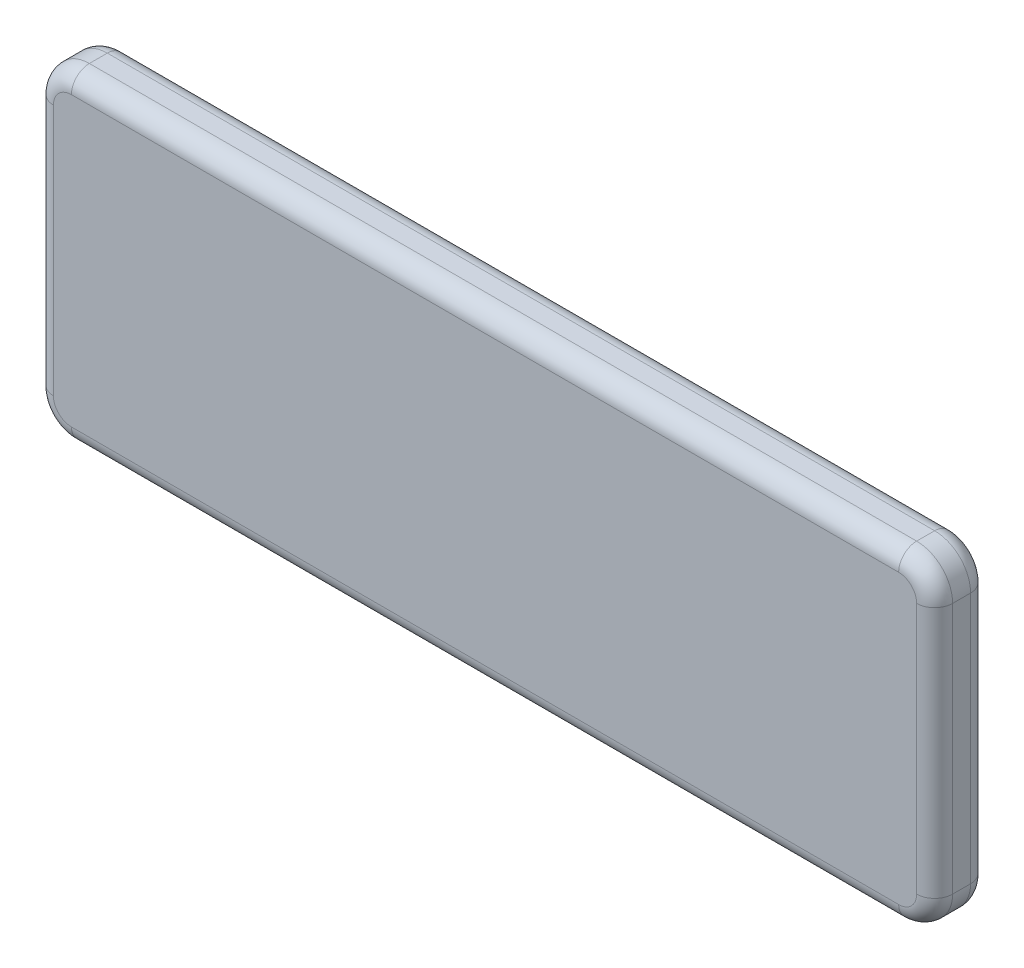
ISO-10303-21;
HEADER;
FILE_DESCRIPTION(('STEP AP214'),'2;1');
FILE_NAME('part.step','',(''),(''),'','','');
FILE_SCHEMA(('AUTOMOTIVE_DESIGN { 1 0 10303 214 1 1 1 1 }'));
ENDSEC;
DATA;
#1=APPLICATION_CONTEXT('core data for automotive mechanical design processes');
#2=APPLICATION_PROTOCOL_DEFINITION('international standard','automotive_design',2000,#1);
#3=PRODUCT_CONTEXT('',#1,'mechanical');
#4=PRODUCT('Part','Part','',(#3));
#5=PRODUCT_RELATED_PRODUCT_CATEGORY('part','',(#4));
#6=PRODUCT_DEFINITION_FORMATION('','',#4);
#7=PRODUCT_DEFINITION_CONTEXT('part definition',#1,'design');
#8=PRODUCT_DEFINITION('design','',#6,#7);
#9=PRODUCT_DEFINITION_SHAPE('','',#8);
#10=(LENGTH_UNIT() NAMED_UNIT(*) SI_UNIT(.MILLI.,.METRE.));
#11=(NAMED_UNIT(*) PLANE_ANGLE_UNIT() SI_UNIT($,.RADIAN.));
#12=(NAMED_UNIT(*) SI_UNIT($,.STERADIAN.) SOLID_ANGLE_UNIT());
#13=UNCERTAINTY_MEASURE_WITH_UNIT(LENGTH_MEASURE(1.E-05),#10,'distance_accuracy_value','');
#14=(GEOMETRIC_REPRESENTATION_CONTEXT(3) GLOBAL_UNCERTAINTY_ASSIGNED_CONTEXT((#13)) GLOBAL_UNIT_ASSIGNED_CONTEXT((#10,
#11,#12)) REPRESENTATION_CONTEXT('',''));
#15=CARTESIAN_POINT('',(0.,0.,0.));
#16=DIRECTION('',(0.,0.,1.));
#17=DIRECTION('',(1.,0.,0.));
#18=AXIS2_PLACEMENT_3D('',#15,#16,#17);
#19=CARTESIAN_POINT('',(125.,45.,15.));
#20=DIRECTION('',(-1.,0.,0.));
#21=DIRECTION('',(0.,0.,1.));
#22=AXIS2_PLACEMENT_3D('',#19,#20,#21);
#23=PLANE('',#22);
#24=DIRECTION('',(0.,0.,-1.));
#25=VECTOR('',#24,1.);
#26=CARTESIAN_POINT('',(125.,35.,15.));
#27=LINE('',#26,#25);
#28=CARTESIAN_POINT('',(125.,35.,5.));
#29=VERTEX_POINT('',#28);
#30=CARTESIAN_POINT('',(125.,35.,10.));
#31=VERTEX_POINT('',#30);
#32=EDGE_CURVE('E290',#29,#31,#27,.F.);
#33=ORIENTED_EDGE('',*,*,#32,.T.);
#34=DIRECTION('',(0.,1.,0.));
#35=VECTOR('',#34,1.);
#36=CARTESIAN_POINT('',(125.,-35.,10.));
#37=LINE('',#36,#35);
#38=CARTESIAN_POINT('',(125.,-35.,10.));
#39=VERTEX_POINT('',#38);
#40=EDGE_CURVE('E190',#31,#39,#37,.F.);
#41=ORIENTED_EDGE('',*,*,#40,.T.);
#42=DIRECTION('',(0.,0.,-1.));
#43=VECTOR('',#42,1.);
#44=CARTESIAN_POINT('',(125.,-35.,15.));
#45=LINE('',#44,#43);
#46=CARTESIAN_POINT('',(125.,-35.,5.));
#47=VERTEX_POINT('',#46);
#48=EDGE_CURVE('E295',#39,#47,#45,.T.);
#49=ORIENTED_EDGE('',*,*,#48,.T.);
#50=DIRECTION('',(0.,1.,0.));
#51=VECTOR('',#50,1.);
#52=CARTESIAN_POINT('',(125.,45.,5.));
#53=LINE('',#52,#51);
#54=EDGE_CURVE('E188',#47,#29,#53,.T.);
#55=ORIENTED_EDGE('',*,*,#54,.T.);
#56=EDGE_LOOP('',(#33,#41,#49,#55));
#57=FACE_BOUND('',#56,.T.);
#58=ADVANCED_FACE('F37',(#57),#23,.F.);
#59=CARTESIAN_POINT('',(-125.,45.,15.));
#60=DIRECTION('',(0.,-1.,0.));
#61=DIRECTION('',(0.,0.,-1.));
#62=AXIS2_PLACEMENT_3D('',#59,#60,#61);
#63=PLANE('',#62);
#64=DIRECTION('',(0.,0.,-1.));
#65=VECTOR('',#64,1.);
#66=CARTESIAN_POINT('',(-115.,45.,15.));
#67=LINE('',#66,#65);
#68=CARTESIAN_POINT('',(-115.,45.,5.));
#69=VERTEX_POINT('',#68);
#70=CARTESIAN_POINT('',(-115.,45.,10.));
#71=VERTEX_POINT('',#70);
#72=EDGE_CURVE('E245',#69,#71,#67,.F.);
#73=ORIENTED_EDGE('',*,*,#72,.T.);
#74=DIRECTION('',(-1.,0.,0.));
#75=VECTOR('',#74,1.);
#76=CARTESIAN_POINT('',(115.,45.,10.));
#77=LINE('',#76,#75);
#78=CARTESIAN_POINT('',(115.,45.,10.));
#79=VERTEX_POINT('',#78);
#80=EDGE_CURVE('E11',#71,#79,#77,.F.);
#81=ORIENTED_EDGE('',*,*,#80,.T.);
#82=DIRECTION('',(0.,0.,-1.));
#83=VECTOR('',#82,1.);
#84=CARTESIAN_POINT('',(115.,45.,15.));
#85=LINE('',#84,#83);
#86=CARTESIAN_POINT('',(115.,45.,5.));
#87=VERTEX_POINT('',#86);
#88=EDGE_CURVE('E326',#79,#87,#85,.T.);
#89=ORIENTED_EDGE('',*,*,#88,.T.);
#90=DIRECTION('',(-1.,0.,0.));
#91=VECTOR('',#90,1.);
#92=CARTESIAN_POINT('',(-125.,45.,5.));
#93=LINE('',#92,#91);
#94=EDGE_CURVE('E46',#87,#69,#93,.T.);
#95=ORIENTED_EDGE('',*,*,#94,.T.);
#96=EDGE_LOOP('',(#73,#81,#89,#95));
#97=FACE_BOUND('',#96,.T.);
#98=ADVANCED_FACE('F342',(#97),#63,.F.);
#99=CARTESIAN_POINT('',(-125.,45.,15.));
#100=DIRECTION('',(1.,0.,0.));
#101=DIRECTION('',(0.,0.,-1.));
#102=AXIS2_PLACEMENT_3D('',#99,#100,#101);
#103=PLANE('',#102);
#104=DIRECTION('',(0.,0.,-1.));
#105=VECTOR('',#104,1.);
#106=CARTESIAN_POINT('',(-125.,-35.,15.));
#107=LINE('',#106,#105);
#108=CARTESIAN_POINT('',(-125.,-35.,5.));
#109=VERTEX_POINT('',#108);
#110=CARTESIAN_POINT('',(-125.,-35.,10.));
#111=VERTEX_POINT('',#110);
#112=EDGE_CURVE('E173',#109,#111,#107,.F.);
#113=ORIENTED_EDGE('',*,*,#112,.T.);
#114=DIRECTION('',(0.,-1.,0.));
#115=VECTOR('',#114,1.);
#116=CARTESIAN_POINT('',(-125.,35.,10.));
#117=LINE('',#116,#115);
#118=CARTESIAN_POINT('',(-125.,35.,10.));
#119=VERTEX_POINT('',#118);
#120=EDGE_CURVE('E206',#111,#119,#117,.F.);
#121=ORIENTED_EDGE('',*,*,#120,.T.);
#122=DIRECTION('',(0.,0.,-1.));
#123=VECTOR('',#122,1.);
#124=CARTESIAN_POINT('',(-125.,35.,15.));
#125=LINE('',#124,#123);
#126=CARTESIAN_POINT('',(-125.,35.,5.));
#127=VERTEX_POINT('',#126);
#128=EDGE_CURVE('E292',#119,#127,#125,.T.);
#129=ORIENTED_EDGE('',*,*,#128,.T.);
#130=DIRECTION('',(0.,-1.,0.));
#131=VECTOR('',#130,1.);
#132=CARTESIAN_POINT('',(-125.,45.,5.));
#133=LINE('',#132,#131);
#134=EDGE_CURVE('E204',#127,#109,#133,.T.);
#135=ORIENTED_EDGE('',*,*,#134,.T.);
#136=EDGE_LOOP('',(#113,#121,#129,#135));
#137=FACE_BOUND('',#136,.T.);
#138=ADVANCED_FACE('F376',(#137),#103,.F.);
#139=CARTESIAN_POINT('',(-125.,-45.,15.));
#140=DIRECTION('',(0.,1.,0.));
#141=DIRECTION('',(0.,0.,1.));
#142=AXIS2_PLACEMENT_3D('',#139,#140,#141);
#143=PLANE('',#142);
#144=DIRECTION('',(0.,0.,-1.));
#145=VECTOR('',#144,1.);
#146=CARTESIAN_POINT('',(115.,-45.,15.));
#147=LINE('',#146,#145);
#148=CARTESIAN_POINT('',(115.,-45.,5.));
#149=VERTEX_POINT('',#148);
#150=CARTESIAN_POINT('',(115.,-45.,10.));
#151=VERTEX_POINT('',#150);
#152=EDGE_CURVE('E289',#149,#151,#147,.F.);
#153=ORIENTED_EDGE('',*,*,#152,.T.);
#154=DIRECTION('',(1.,0.,0.));
#155=VECTOR('',#154,1.);
#156=CARTESIAN_POINT('',(-115.,-45.,10.));
#157=LINE('',#156,#155);
#158=CARTESIAN_POINT('',(-115.,-45.,10.));
#159=VERTEX_POINT('',#158);
#160=EDGE_CURVE('E198',#151,#159,#157,.F.);
#161=ORIENTED_EDGE('',*,*,#160,.T.);
#162=DIRECTION('',(0.,0.,-1.));
#163=VECTOR('',#162,1.);
#164=CARTESIAN_POINT('',(-115.,-45.,15.));
#165=LINE('',#164,#163);
#166=CARTESIAN_POINT('',(-115.,-45.,5.));
#167=VERTEX_POINT('',#166);
#168=EDGE_CURVE('E281',#159,#167,#165,.T.);
#169=ORIENTED_EDGE('',*,*,#168,.T.);
#170=DIRECTION('',(1.,0.,0.));
#171=VECTOR('',#170,1.);
#172=CARTESIAN_POINT('',(-125.,-45.,5.));
#173=LINE('',#172,#171);
#174=EDGE_CURVE('E196',#167,#149,#173,.T.);
#175=ORIENTED_EDGE('',*,*,#174,.T.);
#176=EDGE_LOOP('',(#153,#161,#169,#175));
#177=FACE_BOUND('',#176,.T.);
#178=ADVANCED_FACE('F286',(#177),#143,.F.);
#179=CARTESIAN_POINT('',(0.,0.,15.));
#180=DIRECTION('',(0.,0.,1.));
#181=DIRECTION('',(1.,0.,0.));
#182=AXIS2_PLACEMENT_3D('',#179,#180,#181);
#183=PLANE('',#182);
#184=DIRECTION('',(0.,1.,0.));
#185=VECTOR('',#184,1.);
#186=CARTESIAN_POINT('',(120.,35.,15.));
#187=LINE('',#186,#185);
#188=CARTESIAN_POINT('',(120.,-35.,15.));
#189=VERTEX_POINT('',#188);
#190=CARTESIAN_POINT('',(120.,35.,15.));
#191=VERTEX_POINT('',#190);
#192=EDGE_CURVE('E177',#189,#191,#187,.T.);
#193=ORIENTED_EDGE('',*,*,#192,.T.);
#194=CARTESIAN_POINT('',(115.,35.,15.));
#195=DIRECTION('',(0.,0.,1.));
#196=DIRECTION('',(1.,0.,0.));
#197=AXIS2_PLACEMENT_3D('',#194,#195,#196);
#198=CIRCLE('',#197,5.);
#199=CARTESIAN_POINT('',(115.,40.,15.));
#200=VERTEX_POINT('',#199);
#201=EDGE_CURVE('E158',#191,#200,#198,.T.);
#202=ORIENTED_EDGE('',*,*,#201,.T.);
#203=DIRECTION('',(-1.,0.,0.));
#204=VECTOR('',#203,1.);
#205=CARTESIAN_POINT('',(-115.,40.,15.));
#206=LINE('',#205,#204);
#207=CARTESIAN_POINT('',(-115.,40.,15.));
#208=VERTEX_POINT('',#207);
#209=EDGE_CURVE('E166',#200,#208,#206,.T.);
#210=ORIENTED_EDGE('',*,*,#209,.T.);
#211=CARTESIAN_POINT('',(-115.,35.,15.));
#212=DIRECTION('',(0.,0.,1.));
#213=DIRECTION('',(1.,0.,0.));
#214=AXIS2_PLACEMENT_3D('',#211,#212,#213);
#215=CIRCLE('',#214,5.);
#216=CARTESIAN_POINT('',(-120.,35.,15.));
#217=VERTEX_POINT('',#216);
#218=EDGE_CURVE('E172',#208,#217,#215,.T.);
#219=ORIENTED_EDGE('',*,*,#218,.T.);
#220=DIRECTION('',(0.,-1.,0.));
#221=VECTOR('',#220,1.);
#222=CARTESIAN_POINT('',(-120.,-35.,15.));
#223=LINE('',#222,#221);
#224=CARTESIAN_POINT('',(-120.,-35.,15.));
#225=VERTEX_POINT('',#224);
#226=EDGE_CURVE('E303',#217,#225,#223,.T.);
#227=ORIENTED_EDGE('',*,*,#226,.T.);
#228=CARTESIAN_POINT('',(-115.,-35.,15.));
#229=DIRECTION('',(0.,0.,1.));
#230=DIRECTION('',(1.,0.,0.));
#231=AXIS2_PLACEMENT_3D('',#228,#229,#230);
#232=CIRCLE('',#231,5.);
#233=CARTESIAN_POINT('',(-115.,-40.,15.));
#234=VERTEX_POINT('',#233);
#235=EDGE_CURVE('E305',#225,#234,#232,.T.);
#236=ORIENTED_EDGE('',*,*,#235,.T.);
#237=DIRECTION('',(1.,0.,0.));
#238=VECTOR('',#237,1.);
#239=CARTESIAN_POINT('',(115.,-40.,15.));
#240=LINE('',#239,#238);
#241=CARTESIAN_POINT('',(115.,-40.,15.));
#242=VERTEX_POINT('',#241);
#243=EDGE_CURVE('E307',#234,#242,#240,.T.);
#244=ORIENTED_EDGE('',*,*,#243,.T.);
#245=CARTESIAN_POINT('',(115.,-35.,15.));
#246=DIRECTION('',(0.,0.,1.));
#247=DIRECTION('',(1.,0.,0.));
#248=AXIS2_PLACEMENT_3D('',#245,#246,#247);
#249=CIRCLE('',#248,5.);
#250=EDGE_CURVE('E183',#242,#189,#249,.T.);
#251=ORIENTED_EDGE('',*,*,#250,.T.);
#252=EDGE_LOOP('',(#193,#202,#210,#219,#227,#236,#244,#251));
#253=FACE_BOUND('',#252,.T.);
#254=ADVANCED_FACE('F175',(#253),#183,.T.);
#255=CARTESIAN_POINT('',(0.,0.,0.));
#256=DIRECTION('',(0.,0.,1.));
#257=DIRECTION('',(1.,0.,0.));
#258=AXIS2_PLACEMENT_3D('',#255,#256,#257);
#259=PLANE('',#258);
#260=DIRECTION('',(-1.,0.,0.));
#261=VECTOR('',#260,1.);
#262=CARTESIAN_POINT('',(0.,40.,0.));
#263=LINE('',#262,#261);
#264=CARTESIAN_POINT('',(-115.,40.,0.));
#265=VERTEX_POINT('',#264);
#266=CARTESIAN_POINT('',(115.,40.,0.));
#267=VERTEX_POINT('',#266);
#268=EDGE_CURVE('E212',#265,#267,#263,.F.);
#269=ORIENTED_EDGE('',*,*,#268,.T.);
#270=CARTESIAN_POINT('',(115.,35.,0.));
#271=DIRECTION('',(0.,0.,1.));
#272=DIRECTION('',(1.,0.,0.));
#273=AXIS2_PLACEMENT_3D('',#270,#271,#272);
#274=CIRCLE('',#273,5.);
#275=CARTESIAN_POINT('',(120.,35.,0.));
#276=VERTEX_POINT('',#275);
#277=EDGE_CURVE('E225',#267,#276,#274,.F.);
#278=ORIENTED_EDGE('',*,*,#277,.T.);
#279=DIRECTION('',(0.,1.,0.));
#280=VECTOR('',#279,1.);
#281=CARTESIAN_POINT('',(120.,0.,0.));
#282=LINE('',#281,#280);
#283=CARTESIAN_POINT('',(120.,-35.,0.));
#284=VERTEX_POINT('',#283);
#285=EDGE_CURVE('E61',#276,#284,#282,.F.);
#286=ORIENTED_EDGE('',*,*,#285,.T.);
#287=CARTESIAN_POINT('',(115.,-35.,0.));
#288=DIRECTION('',(0.,0.,1.));
#289=DIRECTION('',(1.,0.,0.));
#290=AXIS2_PLACEMENT_3D('',#287,#288,#289);
#291=CIRCLE('',#290,5.);
#292=CARTESIAN_POINT('',(115.,-40.,0.));
#293=VERTEX_POINT('',#292);
#294=EDGE_CURVE('E222',#284,#293,#291,.F.);
#295=ORIENTED_EDGE('',*,*,#294,.T.);
#296=DIRECTION('',(1.,0.,0.));
#297=VECTOR('',#296,1.);
#298=CARTESIAN_POINT('',(0.,-40.,0.));
#299=LINE('',#298,#297);
#300=CARTESIAN_POINT('',(-115.,-40.,0.));
#301=VERTEX_POINT('',#300);
#302=EDGE_CURVE('E220',#293,#301,#299,.F.);
#303=ORIENTED_EDGE('',*,*,#302,.T.);
#304=CARTESIAN_POINT('',(-115.,-35.,0.));
#305=DIRECTION('',(0.,0.,1.));
#306=DIRECTION('',(1.,0.,0.));
#307=AXIS2_PLACEMENT_3D('',#304,#305,#306);
#308=CIRCLE('',#307,5.);
#309=CARTESIAN_POINT('',(-120.,-35.,0.));
#310=VERTEX_POINT('',#309);
#311=EDGE_CURVE('E218',#301,#310,#308,.F.);
#312=ORIENTED_EDGE('',*,*,#311,.T.);
#313=DIRECTION('',(0.,-1.,0.));
#314=VECTOR('',#313,1.);
#315=CARTESIAN_POINT('',(-120.,0.,0.));
#316=LINE('',#315,#314);
#317=CARTESIAN_POINT('',(-120.,35.,0.));
#318=VERTEX_POINT('',#317);
#319=EDGE_CURVE('E216',#310,#318,#316,.F.);
#320=ORIENTED_EDGE('',*,*,#319,.T.);
#321=CARTESIAN_POINT('',(-115.,35.,0.));
#322=DIRECTION('',(0.,0.,1.));
#323=DIRECTION('',(1.,0.,0.));
#324=AXIS2_PLACEMENT_3D('',#321,#322,#323);
#325=CIRCLE('',#324,5.);
#326=EDGE_CURVE('E214',#318,#265,#325,.F.);
#327=ORIENTED_EDGE('',*,*,#326,.T.);
#328=EDGE_LOOP('',(#269,#278,#286,#295,#303,#312,#320,#327));
#329=FACE_BOUND('',#328,.T.);
#330=ADVANCED_FACE('F331',(#329),#259,.F.);
#331=CARTESIAN_POINT('',(115.,35.,15.));
#332=DIRECTION('',(0.,0.,-1.));
#333=DIRECTION('',(-1.,0.,0.));
#334=AXIS2_PLACEMENT_3D('',#331,#332,#333);
#335=CYLINDRICAL_SURFACE('',#334,10.);
#336=ORIENTED_EDGE('',*,*,#88,.F.);
#337=CARTESIAN_POINT('',(115.,35.,10.));
#338=DIRECTION('',(0.,0.,1.));
#339=DIRECTION('',(1.,0.,0.));
#340=AXIS2_PLACEMENT_3D('',#337,#338,#339);
#341=CIRCLE('',#340,10.);
#342=EDGE_CURVE('E160',#79,#31,#341,.F.);
#343=ORIENTED_EDGE('',*,*,#342,.T.);
#344=ORIENTED_EDGE('',*,*,#32,.F.);
#345=CARTESIAN_POINT('',(115.,35.,5.));
#346=DIRECTION('',(0.,0.,1.));
#347=DIRECTION('',(1.,0.,0.));
#348=AXIS2_PLACEMENT_3D('',#345,#346,#347);
#349=CIRCLE('',#348,10.);
#350=EDGE_CURVE('E179',#29,#87,#349,.T.);
#351=ORIENTED_EDGE('',*,*,#350,.T.);
#352=EDGE_LOOP('',(#336,#343,#344,#351));
#353=FACE_BOUND('',#352,.T.);
#354=ADVANCED_FACE('F324',(#353),#335,.T.);
#355=CARTESIAN_POINT('',(115.,-35.,15.));
#356=DIRECTION('',(0.,0.,-1.));
#357=DIRECTION('',(-1.,0.,0.));
#358=AXIS2_PLACEMENT_3D('',#355,#356,#357);
#359=CYLINDRICAL_SURFACE('',#358,10.);
#360=ORIENTED_EDGE('',*,*,#48,.F.);
#361=CARTESIAN_POINT('',(115.,-35.,10.));
#362=DIRECTION('',(0.,0.,1.));
#363=DIRECTION('',(1.,0.,0.));
#364=AXIS2_PLACEMENT_3D('',#361,#362,#363);
#365=CIRCLE('',#364,10.);
#366=EDGE_CURVE('E194',#39,#151,#365,.F.);
#367=ORIENTED_EDGE('',*,*,#366,.T.);
#368=ORIENTED_EDGE('',*,*,#152,.F.);
#369=CARTESIAN_POINT('',(115.,-35.,5.));
#370=DIRECTION('',(0.,0.,1.));
#371=DIRECTION('',(1.,0.,0.));
#372=AXIS2_PLACEMENT_3D('',#369,#370,#371);
#373=CIRCLE('',#372,10.);
#374=EDGE_CURVE('E192',#149,#47,#373,.T.);
#375=ORIENTED_EDGE('',*,*,#374,.T.);
#376=EDGE_LOOP('',(#360,#367,#368,#375));
#377=FACE_BOUND('',#376,.T.);
#378=ADVANCED_FACE('F382',(#377),#359,.T.);
#379=CARTESIAN_POINT('',(-115.,-35.,15.));
#380=DIRECTION('',(0.,0.,-1.));
#381=DIRECTION('',(-1.,0.,0.));
#382=AXIS2_PLACEMENT_3D('',#379,#380,#381);
#383=CYLINDRICAL_SURFACE('',#382,10.);
#384=ORIENTED_EDGE('',*,*,#168,.F.);
#385=CARTESIAN_POINT('',(-115.,-35.,10.));
#386=DIRECTION('',(0.,0.,1.));
#387=DIRECTION('',(1.,0.,0.));
#388=AXIS2_PLACEMENT_3D('',#385,#386,#387);
#389=CIRCLE('',#388,10.);
#390=EDGE_CURVE('E202',#159,#111,#389,.F.);
#391=ORIENTED_EDGE('',*,*,#390,.T.);
#392=ORIENTED_EDGE('',*,*,#112,.F.);
#393=CARTESIAN_POINT('',(-115.,-35.,5.));
#394=DIRECTION('',(0.,0.,1.));
#395=DIRECTION('',(1.,0.,0.));
#396=AXIS2_PLACEMENT_3D('',#393,#394,#395);
#397=CIRCLE('',#396,10.);
#398=EDGE_CURVE('E200',#109,#167,#397,.T.);
#399=ORIENTED_EDGE('',*,*,#398,.T.);
#400=EDGE_LOOP('',(#384,#391,#392,#399));
#401=FACE_BOUND('',#400,.T.);
#402=ADVANCED_FACE('F280',(#401),#383,.T.);
#403=CARTESIAN_POINT('',(-115.,35.,15.));
#404=DIRECTION('',(0.,0.,-1.));
#405=DIRECTION('',(-1.,0.,0.));
#406=AXIS2_PLACEMENT_3D('',#403,#404,#405);
#407=CYLINDRICAL_SURFACE('',#406,10.);
#408=ORIENTED_EDGE('',*,*,#128,.F.);
#409=CARTESIAN_POINT('',(-115.,35.,10.));
#410=DIRECTION('',(0.,0.,1.));
#411=DIRECTION('',(1.,0.,0.));
#412=AXIS2_PLACEMENT_3D('',#409,#410,#411);
#413=CIRCLE('',#412,10.);
#414=EDGE_CURVE('E210',#119,#71,#413,.F.);
#415=ORIENTED_EDGE('',*,*,#414,.T.);
#416=ORIENTED_EDGE('',*,*,#72,.F.);
#417=CARTESIAN_POINT('',(-115.,35.,5.));
#418=DIRECTION('',(0.,0.,1.));
#419=DIRECTION('',(1.,0.,0.));
#420=AXIS2_PLACEMENT_3D('',#417,#418,#419);
#421=CIRCLE('',#420,10.);
#422=EDGE_CURVE('E208',#69,#127,#421,.T.);
#423=ORIENTED_EDGE('',*,*,#422,.T.);
#424=EDGE_LOOP('',(#408,#415,#416,#423));
#425=FACE_BOUND('',#424,.T.);
#426=ADVANCED_FACE('F369',(#425),#407,.T.);
#427=CARTESIAN_POINT('',(-115.,-35.,10.));
#428=DIRECTION('',(0.,0.,1.));
#429=DIRECTION('',(1.,0.,0.));
#430=AXIS2_PLACEMENT_3D('',#427,#428,#429);
#431=DEGENERATE_TOROIDAL_SURFACE('',#430,5.,5.,.T.);
#432=CARTESIAN_POINT('',(-120.,-35.,10.));
#433=DIRECTION('',(0.,1.,0.));
#434=DIRECTION('',(-1.,0.,0.));
#435=AXIS2_PLACEMENT_3D('',#432,#433,#434);
#436=CIRCLE('',#435,5.);
#437=EDGE_CURVE('E239',#111,#225,#436,.T.);
#438=ORIENTED_EDGE('',*,*,#437,.F.);
#439=ORIENTED_EDGE('',*,*,#390,.F.);
#440=CARTESIAN_POINT('',(-115.,-40.,10.));
#441=DIRECTION('',(1.,0.,0.));
#442=DIRECTION('',(0.,0.,-1.));
#443=AXIS2_PLACEMENT_3D('',#440,#441,#442);
#444=CIRCLE('',#443,5.);
#445=EDGE_CURVE('E242',#234,#159,#444,.T.);
#446=ORIENTED_EDGE('',*,*,#445,.F.);
#447=ORIENTED_EDGE('',*,*,#235,.F.);
#448=EDGE_LOOP('',(#438,#439,#446,#447));
#449=FACE_BOUND('',#448,.T.);
#450=ADVANCED_FACE('F358',(#449),#431,.T.);
#451=CARTESIAN_POINT('',(0.,-40.,10.));
#452=DIRECTION('',(-1.,0.,0.));
#453=DIRECTION('',(0.,0.,1.));
#454=AXIS2_PLACEMENT_3D('',#451,#452,#453);
#455=CYLINDRICAL_SURFACE('',#454,5.);
#456=ORIENTED_EDGE('',*,*,#445,.T.);
#457=ORIENTED_EDGE('',*,*,#160,.F.);
#458=CARTESIAN_POINT('',(115.,-40.,10.));
#459=DIRECTION('',(1.,0.,0.));
#460=DIRECTION('',(0.,0.,-1.));
#461=AXIS2_PLACEMENT_3D('',#458,#459,#460);
#462=CIRCLE('',#461,5.);
#463=EDGE_CURVE('E236',#242,#151,#462,.T.);
#464=ORIENTED_EDGE('',*,*,#463,.F.);
#465=ORIENTED_EDGE('',*,*,#243,.F.);
#466=EDGE_LOOP('',(#456,#457,#464,#465));
#467=FACE_BOUND('',#466,.T.);
#468=ADVANCED_FACE('F361',(#467),#455,.T.);
#469=CARTESIAN_POINT('',(-120.,0.,10.));
#470=DIRECTION('',(0.,1.,0.));
#471=DIRECTION('',(0.,0.,1.));
#472=AXIS2_PLACEMENT_3D('',#469,#470,#471);
#473=CYLINDRICAL_SURFACE('',#472,5.);
#474=ORIENTED_EDGE('',*,*,#437,.T.);
#475=ORIENTED_EDGE('',*,*,#226,.F.);
#476=CARTESIAN_POINT('',(-120.,35.,10.));
#477=DIRECTION('',(0.,1.,0.));
#478=DIRECTION('',(0.,0.,1.));
#479=AXIS2_PLACEMENT_3D('',#476,#477,#478);
#480=CIRCLE('',#479,5.);
#481=EDGE_CURVE('E233',#119,#217,#480,.T.);
#482=ORIENTED_EDGE('',*,*,#481,.F.);
#483=ORIENTED_EDGE('',*,*,#120,.F.);
#484=EDGE_LOOP('',(#474,#475,#482,#483));
#485=FACE_BOUND('',#484,.T.);
#486=ADVANCED_FACE('F354',(#485),#473,.T.);
#487=CARTESIAN_POINT('',(115.,-35.,10.));
#488=DIRECTION('',(0.,0.,1.));
#489=DIRECTION('',(1.,0.,0.));
#490=AXIS2_PLACEMENT_3D('',#487,#488,#489);
#491=DEGENERATE_TOROIDAL_SURFACE('',#490,5.,5.,.T.);
#492=ORIENTED_EDGE('',*,*,#463,.T.);
#493=ORIENTED_EDGE('',*,*,#366,.F.);
#494=CARTESIAN_POINT('',(120.,-35.,10.));
#495=DIRECTION('',(0.,1.,0.));
#496=DIRECTION('',(0.,0.,1.));
#497=AXIS2_PLACEMENT_3D('',#494,#495,#496);
#498=CIRCLE('',#497,5.);
#499=EDGE_CURVE('E230',#189,#39,#498,.T.);
#500=ORIENTED_EDGE('',*,*,#499,.F.);
#501=ORIENTED_EDGE('',*,*,#250,.F.);
#502=EDGE_LOOP('',(#492,#493,#500,#501));
#503=FACE_BOUND('',#502,.T.);
#504=ADVANCED_FACE('F314',(#503),#491,.T.);
#505=CARTESIAN_POINT('',(-115.,35.,10.));
#506=DIRECTION('',(0.,0.,1.));
#507=DIRECTION('',(1.,0.,0.));
#508=AXIS2_PLACEMENT_3D('',#505,#506,#507);
#509=DEGENERATE_TOROIDAL_SURFACE('',#508,5.,5.,.T.);
#510=ORIENTED_EDGE('',*,*,#481,.T.);
#511=ORIENTED_EDGE('',*,*,#218,.F.);
#512=CARTESIAN_POINT('',(-115.,40.,10.));
#513=DIRECTION('',(1.,0.,0.));
#514=DIRECTION('',(0.,0.,-1.));
#515=AXIS2_PLACEMENT_3D('',#512,#513,#514);
#516=CIRCLE('',#515,5.);
#517=EDGE_CURVE('E169',#71,#208,#516,.T.);
#518=ORIENTED_EDGE('',*,*,#517,.F.);
#519=ORIENTED_EDGE('',*,*,#414,.F.);
#520=EDGE_LOOP('',(#510,#511,#518,#519));
#521=FACE_BOUND('',#520,.T.);
#522=ADVANCED_FACE('F349',(#521),#509,.T.);
#523=CARTESIAN_POINT('',(120.,0.,10.));
#524=DIRECTION('',(0.,-1.,0.));
#525=DIRECTION('',(0.,0.,-1.));
#526=AXIS2_PLACEMENT_3D('',#523,#524,#525);
#527=CYLINDRICAL_SURFACE('',#526,5.);
#528=ORIENTED_EDGE('',*,*,#499,.T.);
#529=ORIENTED_EDGE('',*,*,#40,.F.);
#530=CARTESIAN_POINT('',(120.,35.,10.));
#531=DIRECTION('',(0.,1.,0.));
#532=DIRECTION('',(0.,0.,1.));
#533=AXIS2_PLACEMENT_3D('',#530,#531,#532);
#534=CIRCLE('',#533,5.);
#535=EDGE_CURVE('E163',#191,#31,#534,.T.);
#536=ORIENTED_EDGE('',*,*,#535,.F.);
#537=ORIENTED_EDGE('',*,*,#192,.F.);
#538=EDGE_LOOP('',(#528,#529,#536,#537));
#539=FACE_BOUND('',#538,.T.);
#540=ADVANCED_FACE('F317',(#539),#527,.T.);
#541=CARTESIAN_POINT('',(0.,40.,10.));
#542=DIRECTION('',(1.,0.,0.));
#543=DIRECTION('',(0.,0.,-1.));
#544=AXIS2_PLACEMENT_3D('',#541,#542,#543);
#545=CYLINDRICAL_SURFACE('',#544,5.);
#546=ORIENTED_EDGE('',*,*,#517,.T.);
#547=ORIENTED_EDGE('',*,*,#209,.F.);
#548=CARTESIAN_POINT('',(115.,40.,10.));
#549=DIRECTION('',(1.,0.,0.));
#550=DIRECTION('',(0.,0.,-1.));
#551=AXIS2_PLACEMENT_3D('',#548,#549,#550);
#552=CIRCLE('',#551,5.);
#553=EDGE_CURVE('E154',#79,#200,#552,.T.);
#554=ORIENTED_EDGE('',*,*,#553,.F.);
#555=ORIENTED_EDGE('',*,*,#80,.F.);
#556=EDGE_LOOP('',(#546,#547,#554,#555));
#557=FACE_BOUND('',#556,.T.);
#558=ADVANCED_FACE('F167',(#557),#545,.T.);
#559=CARTESIAN_POINT('',(115.,35.,10.));
#560=DIRECTION('',(0.,0.,1.));
#561=DIRECTION('',(1.,0.,0.));
#562=AXIS2_PLACEMENT_3D('',#559,#560,#561);
#563=DEGENERATE_TOROIDAL_SURFACE('',#562,5.,5.,.T.);
#564=ORIENTED_EDGE('',*,*,#535,.T.);
#565=ORIENTED_EDGE('',*,*,#342,.F.);
#566=ORIENTED_EDGE('',*,*,#553,.T.);
#567=ORIENTED_EDGE('',*,*,#201,.F.);
#568=EDGE_LOOP('',(#564,#565,#566,#567));
#569=FACE_BOUND('',#568,.T.);
#570=ADVANCED_FACE('F156',(#569),#563,.T.);
#571=CARTESIAN_POINT('',(-115.,-35.,5.));
#572=DIRECTION('',(0.,0.,1.));
#573=DIRECTION('',(1.,0.,0.));
#574=AXIS2_PLACEMENT_3D('',#571,#572,#573);
#575=DEGENERATE_TOROIDAL_SURFACE('',#574,5.,5.,.T.);
#576=CARTESIAN_POINT('',(-115.,-40.,5.));
#577=DIRECTION('',(1.,0.,0.));
#578=DIRECTION('',(0.,0.,-1.));
#579=AXIS2_PLACEMENT_3D('',#576,#577,#578);
#580=CIRCLE('',#579,5.);
#581=EDGE_CURVE('E260',#167,#301,#580,.T.);
#582=ORIENTED_EDGE('',*,*,#581,.F.);
#583=ORIENTED_EDGE('',*,*,#398,.F.);
#584=CARTESIAN_POINT('',(-120.,-35.,5.));
#585=DIRECTION('',(0.,1.,0.));
#586=DIRECTION('',(-1.,0.,0.));
#587=AXIS2_PLACEMENT_3D('',#584,#585,#586);
#588=CIRCLE('',#587,5.);
#589=EDGE_CURVE('E41',#310,#109,#588,.T.);
#590=ORIENTED_EDGE('',*,*,#589,.F.);
#591=ORIENTED_EDGE('',*,*,#311,.F.);
#592=EDGE_LOOP('',(#582,#583,#590,#591));
#593=FACE_BOUND('',#592,.T.);
#594=ADVANCED_FACE('F39',(#593),#575,.T.);
#595=CARTESIAN_POINT('',(-120.,45.,5.));
#596=DIRECTION('',(0.,-1.,0.));
#597=DIRECTION('',(0.,0.,-1.));
#598=AXIS2_PLACEMENT_3D('',#595,#596,#597);
#599=CYLINDRICAL_SURFACE('',#598,5.);
#600=ORIENTED_EDGE('',*,*,#589,.T.);
#601=ORIENTED_EDGE('',*,*,#134,.F.);
#602=CARTESIAN_POINT('',(-120.,35.,5.));
#603=DIRECTION('',(0.,1.,0.));
#604=DIRECTION('',(0.,0.,1.));
#605=AXIS2_PLACEMENT_3D('',#602,#603,#604);
#606=CIRCLE('',#605,5.);
#607=EDGE_CURVE('E258',#318,#127,#606,.T.);
#608=ORIENTED_EDGE('',*,*,#607,.F.);
#609=ORIENTED_EDGE('',*,*,#319,.F.);
#610=EDGE_LOOP('',(#600,#601,#608,#609));
#611=FACE_BOUND('',#610,.T.);
#612=ADVANCED_FACE('F271',(#611),#599,.T.);
#613=CARTESIAN_POINT('',(-125.,-40.,5.));
#614=DIRECTION('',(1.,0.,0.));
#615=DIRECTION('',(0.,0.,-1.));
#616=AXIS2_PLACEMENT_3D('',#613,#614,#615);
#617=CYLINDRICAL_SURFACE('',#616,5.);
#618=ORIENTED_EDGE('',*,*,#581,.T.);
#619=ORIENTED_EDGE('',*,*,#302,.F.);
#620=CARTESIAN_POINT('',(115.,-40.,5.));
#621=DIRECTION('',(1.,0.,0.));
#622=DIRECTION('',(0.,0.,-1.));
#623=AXIS2_PLACEMENT_3D('',#620,#621,#622);
#624=CIRCLE('',#623,5.);
#625=EDGE_CURVE('E255',#149,#293,#624,.T.);
#626=ORIENTED_EDGE('',*,*,#625,.F.);
#627=ORIENTED_EDGE('',*,*,#174,.F.);
#628=EDGE_LOOP('',(#618,#619,#626,#627));
#629=FACE_BOUND('',#628,.T.);
#630=ADVANCED_FACE('F430',(#629),#617,.T.);
#631=CARTESIAN_POINT('',(-115.,35.,5.));
#632=DIRECTION('',(0.,0.,1.));
#633=DIRECTION('',(1.,0.,0.));
#634=AXIS2_PLACEMENT_3D('',#631,#632,#633);
#635=DEGENERATE_TOROIDAL_SURFACE('',#634,5.,5.,.T.);
#636=ORIENTED_EDGE('',*,*,#607,.T.);
#637=ORIENTED_EDGE('',*,*,#422,.F.);
#638=CARTESIAN_POINT('',(-115.,40.,5.));
#639=DIRECTION('',(1.,0.,0.));
#640=DIRECTION('',(0.,0.,-1.));
#641=AXIS2_PLACEMENT_3D('',#638,#639,#640);
#642=CIRCLE('',#641,5.);
#643=EDGE_CURVE('E252',#265,#69,#642,.T.);
#644=ORIENTED_EDGE('',*,*,#643,.F.);
#645=ORIENTED_EDGE('',*,*,#326,.F.);
#646=EDGE_LOOP('',(#636,#637,#644,#645));
#647=FACE_BOUND('',#646,.T.);
#648=ADVANCED_FACE('F436',(#647),#635,.T.);
#649=CARTESIAN_POINT('',(115.,-35.,5.));
#650=DIRECTION('',(0.,0.,1.));
#651=DIRECTION('',(1.,0.,0.));
#652=AXIS2_PLACEMENT_3D('',#649,#650,#651);
#653=DEGENERATE_TOROIDAL_SURFACE('',#652,5.,5.,.T.);
#654=ORIENTED_EDGE('',*,*,#625,.T.);
#655=ORIENTED_EDGE('',*,*,#294,.F.);
#656=CARTESIAN_POINT('',(120.,-35.,5.));
#657=DIRECTION('',(0.,1.,0.));
#658=DIRECTION('',(0.,0.,1.));
#659=AXIS2_PLACEMENT_3D('',#656,#657,#658);
#660=CIRCLE('',#659,5.);
#661=EDGE_CURVE('E249',#47,#284,#660,.T.);
#662=ORIENTED_EDGE('',*,*,#661,.F.);
#663=ORIENTED_EDGE('',*,*,#374,.F.);
#664=EDGE_LOOP('',(#654,#655,#662,#663));
#665=FACE_BOUND('',#664,.T.);
#666=ADVANCED_FACE('F443',(#665),#653,.T.);
#667=CARTESIAN_POINT('',(-125.,40.,5.));
#668=DIRECTION('',(-1.,0.,0.));
#669=DIRECTION('',(0.,0.,1.));
#670=AXIS2_PLACEMENT_3D('',#667,#668,#669);
#671=CYLINDRICAL_SURFACE('',#670,5.);
#672=ORIENTED_EDGE('',*,*,#643,.T.);
#673=ORIENTED_EDGE('',*,*,#94,.F.);
#674=CARTESIAN_POINT('',(115.,40.,5.));
#675=DIRECTION('',(1.,0.,0.));
#676=DIRECTION('',(0.,0.,-1.));
#677=AXIS2_PLACEMENT_3D('',#674,#675,#676);
#678=CIRCLE('',#677,5.);
#679=EDGE_CURVE('E247',#267,#87,#678,.T.);
#680=ORIENTED_EDGE('',*,*,#679,.F.);
#681=ORIENTED_EDGE('',*,*,#268,.F.);
#682=EDGE_LOOP('',(#672,#673,#680,#681));
#683=FACE_BOUND('',#682,.T.);
#684=ADVANCED_FACE('F337',(#683),#671,.T.);
#685=CARTESIAN_POINT('',(120.,45.,5.));
#686=DIRECTION('',(0.,1.,0.));
#687=DIRECTION('',(0.,0.,1.));
#688=AXIS2_PLACEMENT_3D('',#685,#686,#687);
#689=CYLINDRICAL_SURFACE('',#688,5.);
#690=ORIENTED_EDGE('',*,*,#661,.T.);
#691=ORIENTED_EDGE('',*,*,#285,.F.);
#692=CARTESIAN_POINT('',(120.,35.,5.));
#693=DIRECTION('',(0.,1.,0.));
#694=DIRECTION('',(0.,0.,1.));
#695=AXIS2_PLACEMENT_3D('',#692,#693,#694);
#696=CIRCLE('',#695,5.);
#697=EDGE_CURVE('E54',#29,#276,#696,.T.);
#698=ORIENTED_EDGE('',*,*,#697,.F.);
#699=ORIENTED_EDGE('',*,*,#54,.F.);
#700=EDGE_LOOP('',(#690,#691,#698,#699));
#701=FACE_BOUND('',#700,.T.);
#702=ADVANCED_FACE('F330',(#701),#689,.T.);
#703=CARTESIAN_POINT('',(115.,35.,5.));
#704=DIRECTION('',(0.,0.,1.));
#705=DIRECTION('',(1.,0.,0.));
#706=AXIS2_PLACEMENT_3D('',#703,#704,#705);
#707=DEGENERATE_TOROIDAL_SURFACE('',#706,5.,5.,.T.);
#708=ORIENTED_EDGE('',*,*,#679,.T.);
#709=ORIENTED_EDGE('',*,*,#350,.F.);
#710=ORIENTED_EDGE('',*,*,#697,.T.);
#711=ORIENTED_EDGE('',*,*,#277,.F.);
#712=EDGE_LOOP('',(#708,#709,#710,#711));
#713=FACE_BOUND('',#712,.T.);
#714=ADVANCED_FACE('F334',(#713),#707,.T.);
#715=CLOSED_SHELL('',(#58,#98,#138,#178,#254,#330,#354,#378,#402,#426,#450,#468,#486,#504,#522,
#540,#558,#570,#594,#612,#630,#648,#666,#684,#702,#714));
#716=MANIFOLD_SOLID_BREP('B2',#715);
#717=ADVANCED_BREP_SHAPE_REPRESENTATION('',(#18,#716),#14);
#718=SHAPE_DEFINITION_REPRESENTATION(#9,#717);
ENDSEC;
END-ISO-10303-21;
